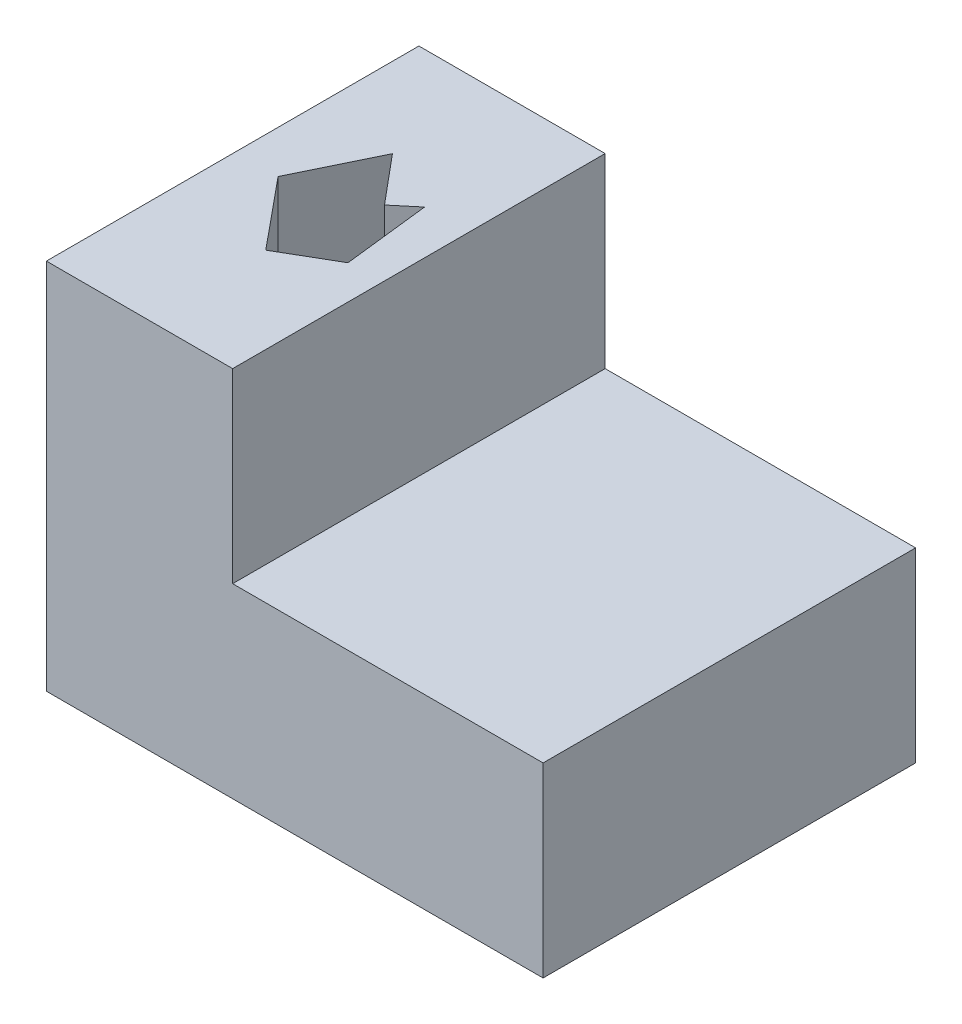
ISO-10303-21;
HEADER;
FILE_DESCRIPTION(('STEP AP214'),'2;1');
FILE_NAME('part.step','',(''),(''),'','','');
FILE_SCHEMA(('AUTOMOTIVE_DESIGN { 1 0 10303 214 1 1 1 1 }'));
ENDSEC;
DATA;
#1=APPLICATION_CONTEXT('core data for automotive mechanical design processes');
#2=APPLICATION_PROTOCOL_DEFINITION('international standard','automotive_design',2000,#1);
#3=PRODUCT_CONTEXT('',#1,'mechanical');
#4=PRODUCT('Part','Part','',(#3));
#5=PRODUCT_RELATED_PRODUCT_CATEGORY('part','',(#4));
#6=PRODUCT_DEFINITION_FORMATION('','',#4);
#7=PRODUCT_DEFINITION_CONTEXT('part definition',#1,'design');
#8=PRODUCT_DEFINITION('design','',#6,#7);
#9=PRODUCT_DEFINITION_SHAPE('','',#8);
#10=(LENGTH_UNIT() NAMED_UNIT(*) SI_UNIT(.MILLI.,.METRE.));
#11=(NAMED_UNIT(*) PLANE_ANGLE_UNIT() SI_UNIT($,.RADIAN.));
#12=(NAMED_UNIT(*) SI_UNIT($,.STERADIAN.) SOLID_ANGLE_UNIT());
#13=UNCERTAINTY_MEASURE_WITH_UNIT(LENGTH_MEASURE(1.E-05),#10,'distance_accuracy_value','');
#14=(GEOMETRIC_REPRESENTATION_CONTEXT(3) GLOBAL_UNCERTAINTY_ASSIGNED_CONTEXT((#13)) GLOBAL_UNIT_ASSIGNED_CONTEXT((#10,
#11,#12)) REPRESENTATION_CONTEXT('',''));
#15=CARTESIAN_POINT('',(0.,0.,0.));
#16=DIRECTION('',(0.,0.,1.));
#17=DIRECTION('',(1.,0.,0.));
#18=AXIS2_PLACEMENT_3D('',#15,#16,#17);
#19=CARTESIAN_POINT('',(200.,0.,150.));
#20=DIRECTION('',(0.,1.,0.));
#21=DIRECTION('',(-1.,0.,0.));
#22=AXIS2_PLACEMENT_3D('',#19,#20,#21);
#23=PLANE('',#22);
#24=DIRECTION('',(-0.43604586440933,0.,0.899924443568192));
#25=VECTOR('',#24,1.);
#26=CARTESIAN_POINT('',(17.1687571493762,0.,73.8806588803965));
#27=LINE('',#26,#25);
#28=CARTESIAN_POINT('',(32.1999093269025,0.,42.8589192799698));
#29=VERTEX_POINT('',#28);
#30=CARTESIAN_POINT('',(17.1687571493762,0.,73.8806588803965));
#31=VERTEX_POINT('',#30);
#32=EDGE_CURVE('E129',#29,#31,#27,.T.);
#33=ORIENTED_EDGE('',*,*,#32,.T.);
#34=DIRECTION('',(0.635860949979395,0.,0.771803635837058));
#35=VECTOR('',#34,1.);
#36=CARTESIAN_POINT('',(40.3551089125817,0.,102.024092744701));
#37=LINE('',#36,#35);
#38=CARTESIAN_POINT('',(40.3551089125817,0.,102.024092744701));
#39=VERTEX_POINT('',#38);
#40=EDGE_CURVE('E123',#31,#39,#37,.T.);
#41=ORIENTED_EDGE('',*,*,#40,.T.);
#42=DIRECTION('',(0.864973870608129,0.,-0.501816902032197));
#43=VECTOR('',#42,1.);
#44=CARTESIAN_POINT('',(61.3027784365812,0.,89.8712463032968));
#45=LINE('',#44,#43);
#46=CARTESIAN_POINT('',(61.3027784365812,0.,89.8712463032968));
#47=VERTEX_POINT('',#46);
#48=EDGE_CURVE('E132',#39,#47,#45,.T.);
#49=ORIENTED_EDGE('',*,*,#48,.T.);
#50=DIRECTION('',(-0.11414884880032,0.,-0.993463658277222));
#51=VECTOR('',#50,1.);
#52=CARTESIAN_POINT('',(57.2983784533291,0.,55.0200331865889));
#53=LINE('',#52,#51);
#54=CARTESIAN_POINT('',(57.2983784533291,0.,55.0200331865889));
#55=VERTEX_POINT('',#54);
#56=EDGE_CURVE('E47',#47,#55,#53,.T.);
#57=ORIENTED_EDGE('',*,*,#56,.T.);
#58=DIRECTION('',(-0.767189392151178,0.,0.64142063933951));
#59=VECTOR('',#58,1.);
#60=CARTESIAN_POINT('',(48.5103084982609,0.,62.3674359359082));
#61=LINE('',#60,#59);
#62=CARTESIAN_POINT('',(48.5103084982609,0.,62.3674359359082));
#63=VERTEX_POINT('',#62);
#64=EDGE_CURVE('E146',#55,#63,#61,.T.);
#65=ORIENTED_EDGE('',*,*,#64,.T.);
#66=DIRECTION('',(-0.64142063933951,0.,-0.767189392151178));
#67=VECTOR('',#66,1.);
#68=CARTESIAN_POINT('',(32.1999093269025,0.,42.8589192799698));
#69=LINE('',#68,#67);
#70=EDGE_CURVE('E149',#63,#29,#69,.T.);
#71=ORIENTED_EDGE('',*,*,#70,.T.);
#72=EDGE_LOOP('',(#33,#41,#49,#57,#65,#71));
#73=FACE_BOUND('',#72,.T.);
#74=DIRECTION('',(1.,0.,0.));
#75=VECTOR('',#74,1.);
#76=CARTESIAN_POINT('',(200.,0.,0.));
#77=LINE('',#76,#75);
#78=CARTESIAN_POINT('',(0.,0.,0.));
#79=VERTEX_POINT('',#78);
#80=CARTESIAN_POINT('',(200.,0.,0.));
#81=VERTEX_POINT('',#80);
#82=EDGE_CURVE('E165',#79,#81,#77,.T.);
#83=ORIENTED_EDGE('',*,*,#82,.T.);
#84=DIRECTION('',(0.,0.,-1.));
#85=VECTOR('',#84,1.);
#86=CARTESIAN_POINT('',(200.,0.,150.));
#87=LINE('',#86,#85);
#88=CARTESIAN_POINT('',(200.,0.,150.));
#89=VERTEX_POINT('',#88);
#90=EDGE_CURVE('E11',#89,#81,#87,.T.);
#91=ORIENTED_EDGE('',*,*,#90,.F.);
#92=DIRECTION('',(1.,0.,0.));
#93=VECTOR('',#92,1.);
#94=CARTESIAN_POINT('',(200.,0.,150.));
#95=LINE('',#94,#93);
#96=CARTESIAN_POINT('',(0.,0.,150.));
#97=VERTEX_POINT('',#96);
#98=EDGE_CURVE('E173',#97,#89,#95,.T.);
#99=ORIENTED_EDGE('',*,*,#98,.F.);
#100=DIRECTION('',(0.,0.,-1.));
#101=VECTOR('',#100,1.);
#102=CARTESIAN_POINT('',(0.,0.,150.));
#103=LINE('',#102,#101);
#104=EDGE_CURVE('E187',#97,#79,#103,.T.);
#105=ORIENTED_EDGE('',*,*,#104,.T.);
#106=EDGE_LOOP('',(#83,#91,#99,#105));
#107=FACE_BOUND('',#106,.T.);
#108=ADVANCED_FACE('F33',(#73,#107),#23,.F.);
#109=CARTESIAN_POINT('',(200.,75.,150.));
#110=DIRECTION('',(-1.,0.,0.));
#111=DIRECTION('',(0.,0.,1.));
#112=AXIS2_PLACEMENT_3D('',#109,#110,#111);
#113=PLANE('',#112);
#114=DIRECTION('',(0.,1.,0.));
#115=VECTOR('',#114,1.);
#116=CARTESIAN_POINT('',(200.,75.,0.));
#117=LINE('',#116,#115);
#118=CARTESIAN_POINT('',(200.,75.,0.));
#119=VERTEX_POINT('',#118);
#120=EDGE_CURVE('E190',#81,#119,#117,.T.);
#121=ORIENTED_EDGE('',*,*,#120,.T.);
#122=DIRECTION('',(0.,0.,-1.));
#123=VECTOR('',#122,1.);
#124=CARTESIAN_POINT('',(200.,75.,150.));
#125=LINE('',#124,#123);
#126=CARTESIAN_POINT('',(200.,75.,150.));
#127=VERTEX_POINT('',#126);
#128=EDGE_CURVE('E40',#127,#119,#125,.T.);
#129=ORIENTED_EDGE('',*,*,#128,.F.);
#130=DIRECTION('',(0.,1.,0.));
#131=VECTOR('',#130,1.);
#132=CARTESIAN_POINT('',(200.,75.,150.));
#133=LINE('',#132,#131);
#134=EDGE_CURVE('E176',#89,#127,#133,.T.);
#135=ORIENTED_EDGE('',*,*,#134,.F.);
#136=ORIENTED_EDGE('',*,*,#90,.T.);
#137=EDGE_LOOP('',(#121,#129,#135,#136));
#138=FACE_BOUND('',#137,.T.);
#139=ADVANCED_FACE('F237',(#138),#113,.F.);
#140=CARTESIAN_POINT('',(75.,75.,150.));
#141=DIRECTION('',(0.,-1.,0.));
#142=DIRECTION('',(0.,0.,-1.));
#143=AXIS2_PLACEMENT_3D('',#140,#141,#142);
#144=PLANE('',#143);
#145=DIRECTION('',(-1.,0.,0.));
#146=VECTOR('',#145,1.);
#147=CARTESIAN_POINT('',(75.,75.,0.));
#148=LINE('',#147,#146);
#149=CARTESIAN_POINT('',(75.,75.,0.));
#150=VERTEX_POINT('',#149);
#151=EDGE_CURVE('E192',#119,#150,#148,.T.);
#152=ORIENTED_EDGE('',*,*,#151,.T.);
#153=DIRECTION('',(0.,0.,-1.));
#154=VECTOR('',#153,1.);
#155=CARTESIAN_POINT('',(75.,75.,150.));
#156=LINE('',#155,#154);
#157=CARTESIAN_POINT('',(75.,75.,150.));
#158=VERTEX_POINT('',#157);
#159=EDGE_CURVE('E207',#158,#150,#156,.T.);
#160=ORIENTED_EDGE('',*,*,#159,.F.);
#161=DIRECTION('',(-1.,0.,0.));
#162=VECTOR('',#161,1.);
#163=CARTESIAN_POINT('',(75.,75.,150.));
#164=LINE('',#163,#162);
#165=EDGE_CURVE('E179',#127,#158,#164,.T.);
#166=ORIENTED_EDGE('',*,*,#165,.F.);
#167=ORIENTED_EDGE('',*,*,#128,.T.);
#168=EDGE_LOOP('',(#152,#160,#166,#167));
#169=FACE_BOUND('',#168,.T.);
#170=ADVANCED_FACE('F214',(#169),#144,.F.);
#171=CARTESIAN_POINT('',(75.,150.,150.));
#172=DIRECTION('',(-1.,0.,0.));
#173=DIRECTION('',(0.,-1.,0.));
#174=AXIS2_PLACEMENT_3D('',#171,#172,#173);
#175=PLANE('',#174);
#176=DIRECTION('',(0.,1.,0.));
#177=VECTOR('',#176,1.);
#178=CARTESIAN_POINT('',(75.,150.,0.));
#179=LINE('',#178,#177);
#180=CARTESIAN_POINT('',(75.,150.,0.));
#181=VERTEX_POINT('',#180);
#182=EDGE_CURVE('E194',#150,#181,#179,.T.);
#183=ORIENTED_EDGE('',*,*,#182,.T.);
#184=DIRECTION('',(0.,0.,-1.));
#185=VECTOR('',#184,1.);
#186=CARTESIAN_POINT('',(75.,150.,150.));
#187=LINE('',#186,#185);
#188=CARTESIAN_POINT('',(75.,150.,150.));
#189=VERTEX_POINT('',#188);
#190=EDGE_CURVE('E204',#189,#181,#187,.T.);
#191=ORIENTED_EDGE('',*,*,#190,.F.);
#192=DIRECTION('',(0.,1.,0.));
#193=VECTOR('',#192,1.);
#194=CARTESIAN_POINT('',(75.,150.,150.));
#195=LINE('',#194,#193);
#196=EDGE_CURVE('E181',#158,#189,#195,.T.);
#197=ORIENTED_EDGE('',*,*,#196,.F.);
#198=ORIENTED_EDGE('',*,*,#159,.T.);
#199=EDGE_LOOP('',(#183,#191,#197,#198));
#200=FACE_BOUND('',#199,.T.);
#201=ADVANCED_FACE('F225',(#200),#175,.F.);
#202=CARTESIAN_POINT('',(0.,150.,150.));
#203=DIRECTION('',(0.,-1.,0.));
#204=DIRECTION('',(0.,0.,-1.));
#205=AXIS2_PLACEMENT_3D('',#202,#203,#204);
#206=PLANE('',#205);
#207=DIRECTION('',(0.864973870608129,0.,-0.501816902032197));
#208=VECTOR('',#207,1.);
#209=CARTESIAN_POINT('',(61.3027784365812,150.,89.8712463032968));
#210=LINE('',#209,#208);
#211=CARTESIAN_POINT('',(40.3551089125817,150.,102.024092744701));
#212=VERTEX_POINT('',#211);
#213=CARTESIAN_POINT('',(61.3027784365812,150.,89.8712463032968));
#214=VERTEX_POINT('',#213);
#215=EDGE_CURVE('E153',#212,#214,#210,.T.);
#216=ORIENTED_EDGE('',*,*,#215,.F.);
#217=DIRECTION('',(0.635860949979395,0.,0.771803635837058));
#218=VECTOR('',#217,1.);
#219=CARTESIAN_POINT('',(40.3551089125817,150.,102.024092744701));
#220=LINE('',#219,#218);
#221=CARTESIAN_POINT('',(17.1687571493762,150.,73.8806588803965));
#222=VERTEX_POINT('',#221);
#223=EDGE_CURVE('E55',#222,#212,#220,.T.);
#224=ORIENTED_EDGE('',*,*,#223,.F.);
#225=DIRECTION('',(-0.43604586440933,0.,0.899924443568192));
#226=VECTOR('',#225,1.);
#227=CARTESIAN_POINT('',(17.1687571493762,150.,73.8806588803965));
#228=LINE('',#227,#226);
#229=CARTESIAN_POINT('',(32.1999093269025,150.,42.8589192799698));
#230=VERTEX_POINT('',#229);
#231=EDGE_CURVE('E139',#230,#222,#228,.T.);
#232=ORIENTED_EDGE('',*,*,#231,.F.);
#233=DIRECTION('',(-0.64142063933951,0.,-0.767189392151178));
#234=VECTOR('',#233,1.);
#235=CARTESIAN_POINT('',(32.1999093269025,150.,42.8589192799698));
#236=LINE('',#235,#234);
#237=CARTESIAN_POINT('',(48.5103084982609,150.,62.3674359359082));
#238=VERTEX_POINT('',#237);
#239=EDGE_CURVE('E142',#238,#230,#236,.T.);
#240=ORIENTED_EDGE('',*,*,#239,.F.);
#241=DIRECTION('',(-0.767189392151178,0.,0.64142063933951));
#242=VECTOR('',#241,1.);
#243=CARTESIAN_POINT('',(48.5103084982609,150.,62.3674359359082));
#244=LINE('',#243,#242);
#245=CARTESIAN_POINT('',(57.2983784533291,150.,55.0200331865889));
#246=VERTEX_POINT('',#245);
#247=EDGE_CURVE('E158',#246,#238,#244,.T.);
#248=ORIENTED_EDGE('',*,*,#247,.F.);
#249=DIRECTION('',(-0.11414884880032,0.,-0.993463658277222));
#250=VECTOR('',#249,1.);
#251=CARTESIAN_POINT('',(57.2983784533291,150.,55.0200331865889));
#252=LINE('',#251,#250);
#253=EDGE_CURVE('E155',#214,#246,#252,.T.);
#254=ORIENTED_EDGE('',*,*,#253,.F.);
#255=EDGE_LOOP('',(#216,#224,#232,#240,#248,#254));
#256=FACE_BOUND('',#255,.T.);
#257=DIRECTION('',(-1.,0.,0.));
#258=VECTOR('',#257,1.);
#259=CARTESIAN_POINT('',(0.,150.,0.));
#260=LINE('',#259,#258);
#261=CARTESIAN_POINT('',(0.,150.,0.));
#262=VERTEX_POINT('',#261);
#263=EDGE_CURVE('E196',#181,#262,#260,.T.);
#264=ORIENTED_EDGE('',*,*,#263,.T.);
#265=DIRECTION('',(0.,0.,-1.));
#266=VECTOR('',#265,1.);
#267=CARTESIAN_POINT('',(0.,150.,150.));
#268=LINE('',#267,#266);
#269=CARTESIAN_POINT('',(0.,150.,150.));
#270=VERTEX_POINT('',#269);
#271=EDGE_CURVE('E201',#270,#262,#268,.T.);
#272=ORIENTED_EDGE('',*,*,#271,.F.);
#273=DIRECTION('',(-1.,0.,0.));
#274=VECTOR('',#273,1.);
#275=CARTESIAN_POINT('',(0.,150.,150.));
#276=LINE('',#275,#274);
#277=EDGE_CURVE('E183',#189,#270,#276,.T.);
#278=ORIENTED_EDGE('',*,*,#277,.F.);
#279=ORIENTED_EDGE('',*,*,#190,.T.);
#280=EDGE_LOOP('',(#264,#272,#278,#279));
#281=FACE_BOUND('',#280,.T.);
#282=ADVANCED_FACE('F229',(#256,#281),#206,.F.);
#283=CARTESIAN_POINT('',(0.,0.,150.));
#284=DIRECTION('',(1.,0.,0.));
#285=DIRECTION('',(0.,0.,-1.));
#286=AXIS2_PLACEMENT_3D('',#283,#284,#285);
#287=PLANE('',#286);
#288=DIRECTION('',(0.,-1.,0.));
#289=VECTOR('',#288,1.);
#290=CARTESIAN_POINT('',(0.,0.,0.));
#291=LINE('',#290,#289);
#292=EDGE_CURVE('E177',#262,#79,#291,.T.);
#293=ORIENTED_EDGE('',*,*,#292,.T.);
#294=ORIENTED_EDGE('',*,*,#104,.F.);
#295=DIRECTION('',(0.,-1.,0.));
#296=VECTOR('',#295,1.);
#297=CARTESIAN_POINT('',(0.,0.,150.));
#298=LINE('',#297,#296);
#299=EDGE_CURVE('E185',#270,#97,#298,.T.);
#300=ORIENTED_EDGE('',*,*,#299,.F.);
#301=ORIENTED_EDGE('',*,*,#271,.T.);
#302=EDGE_LOOP('',(#293,#294,#300,#301));
#303=FACE_BOUND('',#302,.T.);
#304=ADVANCED_FACE('F239',(#303),#287,.F.);
#305=CARTESIAN_POINT('',(0.,0.,150.));
#306=DIRECTION('',(0.,0.,-1.));
#307=DIRECTION('',(-1.,0.,0.));
#308=AXIS2_PLACEMENT_3D('',#305,#306,#307);
#309=PLANE('',#308);
#310=ORIENTED_EDGE('',*,*,#98,.T.);
#311=ORIENTED_EDGE('',*,*,#134,.T.);
#312=ORIENTED_EDGE('',*,*,#165,.T.);
#313=ORIENTED_EDGE('',*,*,#196,.T.);
#314=ORIENTED_EDGE('',*,*,#277,.T.);
#315=ORIENTED_EDGE('',*,*,#299,.T.);
#316=EDGE_LOOP('',(#310,#311,#312,#313,#314,#315));
#317=FACE_BOUND('',#316,.T.);
#318=ADVANCED_FACE('F233',(#317),#309,.F.);
#319=CARTESIAN_POINT('',(0.,0.,0.));
#320=DIRECTION('',(0.,0.,-1.));
#321=DIRECTION('',(-1.,0.,0.));
#322=AXIS2_PLACEMENT_3D('',#319,#320,#321);
#323=PLANE('',#322);
#324=ORIENTED_EDGE('',*,*,#82,.F.);
#325=ORIENTED_EDGE('',*,*,#292,.F.);
#326=ORIENTED_EDGE('',*,*,#263,.F.);
#327=ORIENTED_EDGE('',*,*,#182,.F.);
#328=ORIENTED_EDGE('',*,*,#151,.F.);
#329=ORIENTED_EDGE('',*,*,#120,.F.);
#330=EDGE_LOOP('',(#324,#325,#326,#327,#328,#329));
#331=FACE_BOUND('',#330,.T.);
#332=ADVANCED_FACE('F220',(#331),#323,.T.);
#333=CARTESIAN_POINT('',(40.3551089125817,0.,102.024092744701));
#334=DIRECTION('',(-0.771803635837058,0.,0.635860949979395));
#335=DIRECTION('',(0.635860949979395,0.,0.771803635837058));
#336=AXIS2_PLACEMENT_3D('',#333,#334,#335);
#337=PLANE('',#336);
#338=ORIENTED_EDGE('',*,*,#223,.T.);
#339=DIRECTION('',(0.,1.,0.));
#340=VECTOR('',#339,1.);
#341=CARTESIAN_POINT('',(40.3551089125817,0.,102.024092744701));
#342=LINE('',#341,#340);
#343=EDGE_CURVE('E119',#39,#212,#342,.T.);
#344=ORIENTED_EDGE('',*,*,#343,.F.);
#345=ORIENTED_EDGE('',*,*,#40,.F.);
#346=DIRECTION('',(0.,1.,0.));
#347=VECTOR('',#346,1.);
#348=CARTESIAN_POINT('',(17.1687571493762,0.,73.8806588803965));
#349=LINE('',#348,#347);
#350=EDGE_CURVE('E163',#31,#222,#349,.T.);
#351=ORIENTED_EDGE('',*,*,#350,.T.);
#352=EDGE_LOOP('',(#338,#344,#345,#351));
#353=FACE_BOUND('',#352,.T.);
#354=ADVANCED_FACE('F121',(#353),#337,.F.);
#355=CARTESIAN_POINT('',(17.1687571493762,0.,73.8806588803965));
#356=DIRECTION('',(-0.899924443568192,0.,-0.43604586440933));
#357=DIRECTION('',(-0.43604586440933,0.,0.899924443568192));
#358=AXIS2_PLACEMENT_3D('',#355,#356,#357);
#359=PLANE('',#358);
#360=ORIENTED_EDGE('',*,*,#231,.T.);
#361=ORIENTED_EDGE('',*,*,#350,.F.);
#362=ORIENTED_EDGE('',*,*,#32,.F.);
#363=DIRECTION('',(0.,1.,0.));
#364=VECTOR('',#363,1.);
#365=CARTESIAN_POINT('',(32.1999093269025,0.,42.8589192799698));
#366=LINE('',#365,#364);
#367=EDGE_CURVE('E166',#29,#230,#366,.T.);
#368=ORIENTED_EDGE('',*,*,#367,.T.);
#369=EDGE_LOOP('',(#360,#361,#362,#368));
#370=FACE_BOUND('',#369,.T.);
#371=ADVANCED_FACE('F281',(#370),#359,.F.);
#372=CARTESIAN_POINT('',(32.1999093269025,0.,42.8589192799698));
#373=DIRECTION('',(0.767189392151178,0.,-0.64142063933951));
#374=DIRECTION('',(-0.64142063933951,0.,-0.767189392151178));
#375=AXIS2_PLACEMENT_3D('',#372,#373,#374);
#376=PLANE('',#375);
#377=ORIENTED_EDGE('',*,*,#239,.T.);
#378=ORIENTED_EDGE('',*,*,#367,.F.);
#379=ORIENTED_EDGE('',*,*,#70,.F.);
#380=DIRECTION('',(0.,1.,0.));
#381=VECTOR('',#380,1.);
#382=CARTESIAN_POINT('',(48.5103084982609,0.,62.3674359359082));
#383=LINE('',#382,#381);
#384=EDGE_CURVE('E168',#63,#238,#383,.T.);
#385=ORIENTED_EDGE('',*,*,#384,.T.);
#386=EDGE_LOOP('',(#377,#378,#379,#385));
#387=FACE_BOUND('',#386,.T.);
#388=ADVANCED_FACE('F292',(#387),#376,.F.);
#389=CARTESIAN_POINT('',(48.5103084982609,0.,62.3674359359082));
#390=DIRECTION('',(-0.64142063933951,0.,-0.767189392151178));
#391=DIRECTION('',(-0.767189392151178,0.,0.64142063933951));
#392=AXIS2_PLACEMENT_3D('',#389,#390,#391);
#393=PLANE('',#392);
#394=ORIENTED_EDGE('',*,*,#247,.T.);
#395=ORIENTED_EDGE('',*,*,#384,.F.);
#396=ORIENTED_EDGE('',*,*,#64,.F.);
#397=DIRECTION('',(0.,1.,0.));
#398=VECTOR('',#397,1.);
#399=CARTESIAN_POINT('',(57.2983784533291,0.,55.0200331865889));
#400=LINE('',#399,#398);
#401=EDGE_CURVE('E170',#55,#246,#400,.T.);
#402=ORIENTED_EDGE('',*,*,#401,.T.);
#403=EDGE_LOOP('',(#394,#395,#396,#402));
#404=FACE_BOUND('',#403,.T.);
#405=ADVANCED_FACE('F302',(#404),#393,.F.);
#406=CARTESIAN_POINT('',(57.2983784533291,0.,55.0200331865889));
#407=DIRECTION('',(0.993463658277222,0.,-0.11414884880032));
#408=DIRECTION('',(-0.11414884880032,0.,-0.993463658277222));
#409=AXIS2_PLACEMENT_3D('',#406,#407,#408);
#410=PLANE('',#409);
#411=ORIENTED_EDGE('',*,*,#253,.T.);
#412=ORIENTED_EDGE('',*,*,#401,.F.);
#413=ORIENTED_EDGE('',*,*,#56,.F.);
#414=DIRECTION('',(0.,1.,0.));
#415=VECTOR('',#414,1.);
#416=CARTESIAN_POINT('',(61.3027784365812,0.,89.8712463032968));
#417=LINE('',#416,#415);
#418=EDGE_CURVE('E128',#47,#214,#417,.T.);
#419=ORIENTED_EDGE('',*,*,#418,.T.);
#420=EDGE_LOOP('',(#411,#412,#413,#419));
#421=FACE_BOUND('',#420,.T.);
#422=ADVANCED_FACE('F312',(#421),#410,.F.);
#423=CARTESIAN_POINT('',(61.3027784365812,0.,89.8712463032968));
#424=DIRECTION('',(0.501816902032197,0.,0.864973870608129));
#425=DIRECTION('',(0.864973870608129,0.,-0.501816902032197));
#426=AXIS2_PLACEMENT_3D('',#423,#424,#425);
#427=PLANE('',#426);
#428=ORIENTED_EDGE('',*,*,#215,.T.);
#429=ORIENTED_EDGE('',*,*,#418,.F.);
#430=ORIENTED_EDGE('',*,*,#48,.F.);
#431=ORIENTED_EDGE('',*,*,#343,.T.);
#432=EDGE_LOOP('',(#428,#429,#430,#431));
#433=FACE_BOUND('',#432,.T.);
#434=ADVANCED_FACE('F133',(#433),#427,.F.);
#435=CLOSED_SHELL('',(#108,#139,#170,#201,#282,#304,#318,#332,#354,#371,#388,#405,#422,#434));
#436=MANIFOLD_SOLID_BREP('B2',#435);
#437=ADVANCED_BREP_SHAPE_REPRESENTATION('',(#18,#436),#14);
#438=SHAPE_DEFINITION_REPRESENTATION(#9,#437);
ENDSEC;
END-ISO-10303-21;
